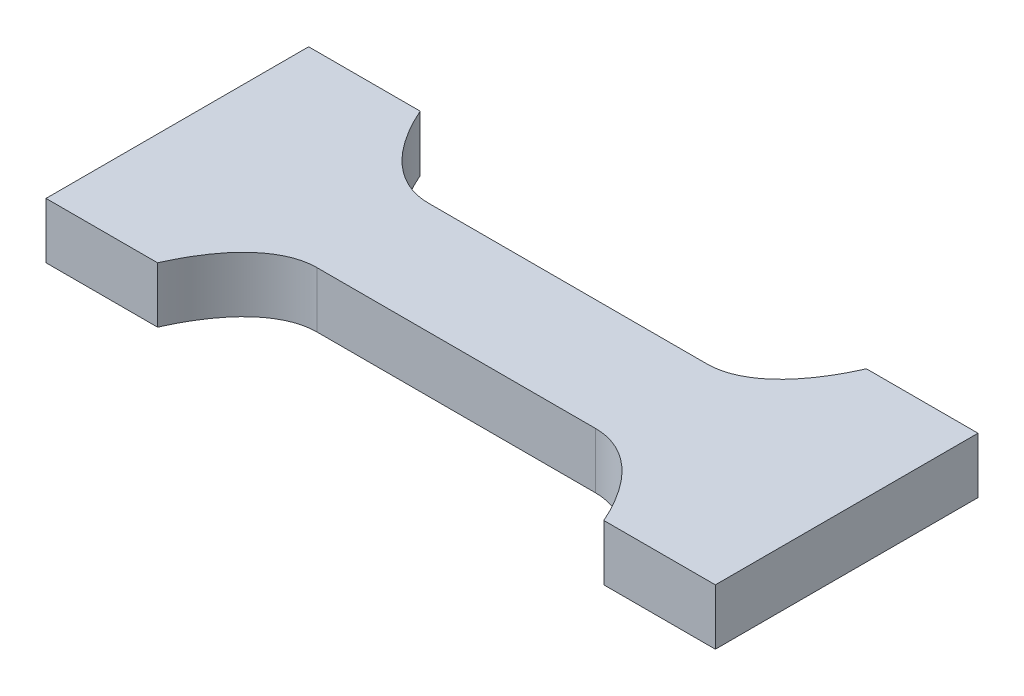
ISO-10303-21;
HEADER;
FILE_DESCRIPTION(('STEP AP214'),'2;1');
FILE_NAME('part.step','',(''),(''),'','','');
FILE_SCHEMA(('AUTOMOTIVE_DESIGN { 1 0 10303 214 1 1 1 1 }'));
ENDSEC;
DATA;
#1=APPLICATION_CONTEXT('core data for automotive mechanical design processes');
#2=APPLICATION_PROTOCOL_DEFINITION('international standard','automotive_design',2000,#1);
#3=PRODUCT_CONTEXT('',#1,'mechanical');
#4=PRODUCT('Part','Part','',(#3));
#5=PRODUCT_RELATED_PRODUCT_CATEGORY('part','',(#4));
#6=PRODUCT_DEFINITION_FORMATION('','',#4);
#7=PRODUCT_DEFINITION_CONTEXT('part definition',#1,'design');
#8=PRODUCT_DEFINITION('design','',#6,#7);
#9=PRODUCT_DEFINITION_SHAPE('','',#8);
#10=(LENGTH_UNIT() NAMED_UNIT(*) SI_UNIT(.MILLI.,.METRE.));
#11=(NAMED_UNIT(*) PLANE_ANGLE_UNIT() SI_UNIT($,.RADIAN.));
#12=(NAMED_UNIT(*) SI_UNIT($,.STERADIAN.) SOLID_ANGLE_UNIT());
#13=UNCERTAINTY_MEASURE_WITH_UNIT(LENGTH_MEASURE(1.E-05),#10,'distance_accuracy_value','');
#14=(GEOMETRIC_REPRESENTATION_CONTEXT(3) GLOBAL_UNCERTAINTY_ASSIGNED_CONTEXT((#13)) GLOBAL_UNIT_ASSIGNED_CONTEXT((#10,
#11,#12)) REPRESENTATION_CONTEXT('',''));
#15=CARTESIAN_POINT('',(0.,0.,0.));
#16=DIRECTION('',(0.,0.,1.));
#17=DIRECTION('',(1.,0.,0.));
#18=AXIS2_PLACEMENT_3D('',#15,#16,#17);
#19=CARTESIAN_POINT('',(54.,4.,-3.));
#20=DIRECTION('',(0.,0.,1.));
#21=DIRECTION('',(1.,0.,0.));
#22=AXIS2_PLACEMENT_3D('',#19,#20,#21);
#23=PLANE('',#22);
#24=DIRECTION('',(-1.,0.,0.));
#25=VECTOR('',#24,1.);
#26=CARTESIAN_POINT('',(54.,1.,-3.));
#27=LINE('',#26,#25);
#28=CARTESIAN_POINT('',(78.,1.,-3.));
#29=VERTEX_POINT('',#28);
#30=CARTESIAN_POINT('',(63.,1.,-3.));
#31=VERTEX_POINT('',#30);
#32=EDGE_CURVE('E163',#29,#31,#27,.T.);
#33=ORIENTED_EDGE('',*,*,#32,.T.);
#34=DIRECTION('',(0.,-1.,0.));
#35=VECTOR('',#34,1.);
#36=CARTESIAN_POINT('',(63.,4.,-3.));
#37=LINE('',#36,#35);
#38=CARTESIAN_POINT('',(63.,4.,-3.));
#39=VERTEX_POINT('',#38);
#40=EDGE_CURVE('E166',#39,#31,#37,.T.);
#41=ORIENTED_EDGE('',*,*,#40,.F.);
#42=DIRECTION('',(-1.,0.,0.));
#43=VECTOR('',#42,1.);
#44=CARTESIAN_POINT('',(54.,4.,-3.));
#45=LINE('',#44,#43);
#46=CARTESIAN_POINT('',(78.,4.,-3.));
#47=VERTEX_POINT('',#46);
#48=EDGE_CURVE('E86',#47,#39,#45,.T.);
#49=ORIENTED_EDGE('',*,*,#48,.F.);
#50=DIRECTION('',(0.,-1.,0.));
#51=VECTOR('',#50,1.);
#52=CARTESIAN_POINT('',(78.,4.,-3.));
#53=LINE('',#52,#51);
#54=EDGE_CURVE('E144',#47,#29,#53,.T.);
#55=ORIENTED_EDGE('',*,*,#54,.T.);
#56=EDGE_LOOP('',(#33,#41,#49,#55));
#57=FACE_BOUND('',#56,.T.);
#58=ADVANCED_FACE('F36',(#57),#23,.F.);
#59=CARTESIAN_POINT('',(54.,4.,-15.));
#60=DIRECTION('',(0.,1.,0.));
#61=DIRECTION('',(0.,0.,1.));
#62=AXIS2_PLACEMENT_3D('',#59,#60,#61);
#63=PLANE('',#62);
#64=ORIENTED_EDGE('',*,*,#48,.T.);
#65=CARTESIAN_POINT('',(63.,4.,-3.));
#66=CARTESIAN_POINT('',(61.2509842672249,4.,-3.));
#67=CARTESIAN_POINT('',(59.6568651670156,4.,-4.4392224676436));
#68=CARTESIAN_POINT('',(58.5,4.,-7.06274606680623));
#69=(BOUNDED_CURVE() B_SPLINE_CURVE(3,(#65,#66,#67,#68),.UNSPECIFIED.,.F.,
.F.) B_SPLINE_CURVE_WITH_KNOTS((4,4),(0.,1.),
.UNSPECIFIED.) CURVE() GEOMETRIC_REPRESENTATION_ITEM() RATIONAL_B_SPLINE_CURVE((1.,
0.940958551844098,0.940958551844098,1.)) REPRESENTATION_ITEM(''));
#70=CARTESIAN_POINT('',(58.5,4.,-7.06274606680623));
#71=VERTEX_POINT('',#70);
#72=EDGE_CURVE('E240',#39,#71,#69,.T.);
#73=ORIENTED_EDGE('',*,*,#72,.T.);
#74=DIRECTION('',(-1.,0.,0.));
#75=VECTOR('',#74,1.);
#76=CARTESIAN_POINT('',(52.5,4.,-7.06274606680623));
#77=LINE('',#76,#75);
#78=CARTESIAN_POINT('',(52.5,4.,-7.06274606680623));
#79=VERTEX_POINT('',#78);
#80=EDGE_CURVE('E95',#71,#79,#77,.T.);
#81=ORIENTED_EDGE('',*,*,#80,.T.);
#82=DIRECTION('',(0.,0.,1.));
#83=VECTOR('',#82,1.);
#84=CARTESIAN_POINT('',(52.5,4.,0.));
#85=LINE('',#84,#83);
#86=CARTESIAN_POINT('',(52.5,4.,7.06274606680623));
#87=VERTEX_POINT('',#86);
#88=EDGE_CURVE('E270',#79,#87,#85,.T.);
#89=ORIENTED_EDGE('',*,*,#88,.T.);
#90=DIRECTION('',(-1.,0.,0.));
#91=VECTOR('',#90,1.);
#92=CARTESIAN_POINT('',(52.5,4.,7.06274606680623));
#93=LINE('',#92,#91);
#94=CARTESIAN_POINT('',(58.5,4.,7.06274606680623));
#95=VERTEX_POINT('',#94);
#96=EDGE_CURVE('E274',#95,#87,#93,.T.);
#97=ORIENTED_EDGE('',*,*,#96,.F.);
#98=CARTESIAN_POINT('',(63.,4.,3.));
#99=CARTESIAN_POINT('',(61.2509842672249,4.,3.));
#100=CARTESIAN_POINT('',(59.6568651670156,4.,4.4392224676436));
#101=CARTESIAN_POINT('',(58.5,4.,7.06274606680623));
#102=(BOUNDED_CURVE() B_SPLINE_CURVE(3,(#98,#99,#100,#101),.UNSPECIFIED.,.F.,
.F.) B_SPLINE_CURVE_WITH_KNOTS((4,4),(0.,1.),
.UNSPECIFIED.) CURVE() GEOMETRIC_REPRESENTATION_ITEM() RATIONAL_B_SPLINE_CURVE((1.,
0.940958551844098,0.940958551844098,1.)) REPRESENTATION_ITEM(''));
#103=CARTESIAN_POINT('',(63.,4.,3.));
#104=VERTEX_POINT('',#103);
#105=EDGE_CURVE('E277',#104,#95,#102,.T.);
#106=ORIENTED_EDGE('',*,*,#105,.F.);
#107=DIRECTION('',(-1.,0.,0.));
#108=VECTOR('',#107,1.);
#109=CARTESIAN_POINT('',(54.,4.,3.));
#110=LINE('',#109,#108);
#111=CARTESIAN_POINT('',(78.,4.,3.));
#112=VERTEX_POINT('',#111);
#113=EDGE_CURVE('E159',#112,#104,#110,.T.);
#114=ORIENTED_EDGE('',*,*,#113,.F.);
#115=CARTESIAN_POINT('',(78.,4.,3.));
#116=CARTESIAN_POINT('',(79.7490157327751,4.,3.));
#117=CARTESIAN_POINT('',(81.3431348329844,4.,4.4392224676436));
#118=CARTESIAN_POINT('',(82.5,4.,7.06274606680623));
#119=(BOUNDED_CURVE() B_SPLINE_CURVE(3,(#115,#116,#117,#118),.UNSPECIFIED.,.F.,
.F.) B_SPLINE_CURVE_WITH_KNOTS((4,4),(0.,1.),
.UNSPECIFIED.) CURVE() GEOMETRIC_REPRESENTATION_ITEM() RATIONAL_B_SPLINE_CURVE((1.,
0.940958551844098,0.940958551844098,1.)) REPRESENTATION_ITEM(''));
#120=CARTESIAN_POINT('',(82.5,4.,7.06274606680623));
#121=VERTEX_POINT('',#120);
#122=EDGE_CURVE('E150',#112,#121,#119,.T.);
#123=ORIENTED_EDGE('',*,*,#122,.T.);
#124=DIRECTION('',(1.,0.,0.));
#125=VECTOR('',#124,1.);
#126=CARTESIAN_POINT('',(88.5,4.,7.06274606680623));
#127=LINE('',#126,#125);
#128=CARTESIAN_POINT('',(88.5,4.,7.06274606680623));
#129=VERTEX_POINT('',#128);
#130=EDGE_CURVE('E160',#121,#129,#127,.T.);
#131=ORIENTED_EDGE('',*,*,#130,.T.);
#132=DIRECTION('',(0.,0.,1.));
#133=VECTOR('',#132,1.);
#134=CARTESIAN_POINT('',(88.5,4.,0.));
#135=LINE('',#134,#133);
#136=CARTESIAN_POINT('',(88.5,4.,-7.06274606680623));
#137=VERTEX_POINT('',#136);
#138=EDGE_CURVE('E139',#137,#129,#135,.T.);
#139=ORIENTED_EDGE('',*,*,#138,.F.);
#140=DIRECTION('',(1.,0.,0.));
#141=VECTOR('',#140,1.);
#142=CARTESIAN_POINT('',(88.5,4.,-7.06274606680623));
#143=LINE('',#142,#141);
#144=CARTESIAN_POINT('',(82.5,4.,-7.06274606680623));
#145=VERTEX_POINT('',#144);
#146=EDGE_CURVE('E126',#145,#137,#143,.T.);
#147=ORIENTED_EDGE('',*,*,#146,.F.);
#148=CARTESIAN_POINT('',(78.,4.,-3.));
#149=CARTESIAN_POINT('',(79.7490157327751,4.,-3.));
#150=CARTESIAN_POINT('',(81.3431348329844,4.,-4.4392224676436));
#151=CARTESIAN_POINT('',(82.5,4.,-7.06274606680623));
#152=(BOUNDED_CURVE() B_SPLINE_CURVE(3,(#148,#149,#150,#151),.UNSPECIFIED.,.F.,
.F.) B_SPLINE_CURVE_WITH_KNOTS((4,4),(0.,1.),
.UNSPECIFIED.) CURVE() GEOMETRIC_REPRESENTATION_ITEM() RATIONAL_B_SPLINE_CURVE((1.,
0.940958551844098,0.940958551844098,1.)) REPRESENTATION_ITEM(''));
#153=EDGE_CURVE('E133',#47,#145,#152,.T.);
#154=ORIENTED_EDGE('',*,*,#153,.F.);
#155=EDGE_LOOP('',(#64,#73,#81,#89,#97,#106,#114,#123,#131,#139,#147,#154));
#156=FACE_BOUND('',#155,.T.);
#157=ADVANCED_FACE('F137',(#156),#63,.T.);
#158=CARTESIAN_POINT('',(54.,1.,-15.));
#159=DIRECTION('',(0.,1.,0.));
#160=DIRECTION('',(0.,0.,1.));
#161=AXIS2_PLACEMENT_3D('',#158,#159,#160);
#162=PLANE('',#161);
#163=DIRECTION('',(-1.,0.,0.));
#164=VECTOR('',#163,1.);
#165=CARTESIAN_POINT('',(54.,1.,3.));
#166=LINE('',#165,#164);
#167=CARTESIAN_POINT('',(78.,1.,3.));
#168=VERTEX_POINT('',#167);
#169=CARTESIAN_POINT('',(63.,1.,3.));
#170=VERTEX_POINT('',#169);
#171=EDGE_CURVE('E39',#168,#170,#166,.T.);
#172=ORIENTED_EDGE('',*,*,#171,.T.);
#173=CARTESIAN_POINT('',(63.,1.,3.));
#174=CARTESIAN_POINT('',(61.2509842672249,1.,3.));
#175=CARTESIAN_POINT('',(59.6568651670156,1.,4.4392224676436));
#176=CARTESIAN_POINT('',(58.5,1.,7.06274606680623));
#177=(BOUNDED_CURVE() B_SPLINE_CURVE(3,(#173,#174,#175,#176),.UNSPECIFIED.,.F.,
.F.) B_SPLINE_CURVE_WITH_KNOTS((4,4),(0.,1.),
.UNSPECIFIED.) CURVE() GEOMETRIC_REPRESENTATION_ITEM() RATIONAL_B_SPLINE_CURVE((1.,
0.940958551844098,0.940958551844098,1.)) REPRESENTATION_ITEM(''));
#178=CARTESIAN_POINT('',(58.5,1.,7.06274606680623));
#179=VERTEX_POINT('',#178);
#180=EDGE_CURVE('E278',#170,#179,#177,.T.);
#181=ORIENTED_EDGE('',*,*,#180,.T.);
#182=DIRECTION('',(-1.,0.,0.));
#183=VECTOR('',#182,1.);
#184=CARTESIAN_POINT('',(52.5,1.,7.06274606680623));
#185=LINE('',#184,#183);
#186=CARTESIAN_POINT('',(52.5,1.,7.06274606680623));
#187=VERTEX_POINT('',#186);
#188=EDGE_CURVE('E291',#179,#187,#185,.T.);
#189=ORIENTED_EDGE('',*,*,#188,.T.);
#190=DIRECTION('',(0.,0.,1.));
#191=VECTOR('',#190,1.);
#192=CARTESIAN_POINT('',(52.5,1.,0.));
#193=LINE('',#192,#191);
#194=CARTESIAN_POINT('',(52.5,1.,-7.06274606680623));
#195=VERTEX_POINT('',#194);
#196=EDGE_CURVE('E249',#195,#187,#193,.T.);
#197=ORIENTED_EDGE('',*,*,#196,.F.);
#198=DIRECTION('',(-1.,0.,0.));
#199=VECTOR('',#198,1.);
#200=CARTESIAN_POINT('',(52.5,1.,-7.06274606680623));
#201=LINE('',#200,#199);
#202=CARTESIAN_POINT('',(58.5,1.,-7.06274606680623));
#203=VERTEX_POINT('',#202);
#204=EDGE_CURVE('E246',#203,#195,#201,.T.);
#205=ORIENTED_EDGE('',*,*,#204,.F.);
#206=CARTESIAN_POINT('',(63.,1.,-3.));
#207=CARTESIAN_POINT('',(61.2509842672249,1.,-3.));
#208=CARTESIAN_POINT('',(59.6568651670156,1.,-4.4392224676436));
#209=CARTESIAN_POINT('',(58.5,1.,-7.06274606680623));
#210=(BOUNDED_CURVE() B_SPLINE_CURVE(3,(#206,#207,#208,#209),.UNSPECIFIED.,.F.,
.F.) B_SPLINE_CURVE_WITH_KNOTS((4,4),(0.,1.),
.UNSPECIFIED.) CURVE() GEOMETRIC_REPRESENTATION_ITEM() RATIONAL_B_SPLINE_CURVE((1.,
0.940958551844098,0.940958551844098,1.)) REPRESENTATION_ITEM(''));
#211=EDGE_CURVE('E238',#31,#203,#210,.T.);
#212=ORIENTED_EDGE('',*,*,#211,.F.);
#213=ORIENTED_EDGE('',*,*,#32,.F.);
#214=CARTESIAN_POINT('',(78.,1.,-3.));
#215=CARTESIAN_POINT('',(79.7490157327751,1.,-3.));
#216=CARTESIAN_POINT('',(81.3431348329844,1.,-4.4392224676436));
#217=CARTESIAN_POINT('',(82.5,1.,-7.06274606680623));
#218=(BOUNDED_CURVE() B_SPLINE_CURVE(3,(#214,#215,#216,#217),.UNSPECIFIED.,.F.,
.F.) B_SPLINE_CURVE_WITH_KNOTS((4,4),(0.,1.),
.UNSPECIFIED.) CURVE() GEOMETRIC_REPRESENTATION_ITEM() RATIONAL_B_SPLINE_CURVE((1.,
0.940958551844098,0.940958551844098,1.)) REPRESENTATION_ITEM(''));
#219=CARTESIAN_POINT('',(82.5,1.,-7.06274606680623));
#220=VERTEX_POINT('',#219);
#221=EDGE_CURVE('E176',#29,#220,#218,.T.);
#222=ORIENTED_EDGE('',*,*,#221,.T.);
#223=DIRECTION('',(1.,0.,0.));
#224=VECTOR('',#223,1.);
#225=CARTESIAN_POINT('',(88.5,1.,-7.06274606680623));
#226=LINE('',#225,#224);
#227=CARTESIAN_POINT('',(88.5,1.,-7.06274606680623));
#228=VERTEX_POINT('',#227);
#229=EDGE_CURVE('E128',#220,#228,#226,.T.);
#230=ORIENTED_EDGE('',*,*,#229,.T.);
#231=DIRECTION('',(0.,0.,1.));
#232=VECTOR('',#231,1.);
#233=CARTESIAN_POINT('',(88.5,1.,0.));
#234=LINE('',#233,#232);
#235=CARTESIAN_POINT('',(88.5,1.,7.06274606680623));
#236=VERTEX_POINT('',#235);
#237=EDGE_CURVE('E167',#228,#236,#234,.T.);
#238=ORIENTED_EDGE('',*,*,#237,.T.);
#239=DIRECTION('',(1.,0.,0.));
#240=VECTOR('',#239,1.);
#241=CARTESIAN_POINT('',(88.5,1.,7.06274606680623));
#242=LINE('',#241,#240);
#243=CARTESIAN_POINT('',(82.5,1.,7.06274606680623));
#244=VERTEX_POINT('',#243);
#245=EDGE_CURVE('E45',#244,#236,#242,.T.);
#246=ORIENTED_EDGE('',*,*,#245,.F.);
#247=CARTESIAN_POINT('',(78.,1.,3.));
#248=CARTESIAN_POINT('',(79.7490157327751,1.,3.));
#249=CARTESIAN_POINT('',(81.3431348329844,1.,4.4392224676436));
#250=CARTESIAN_POINT('',(82.5,1.,7.06274606680623));
#251=(BOUNDED_CURVE() B_SPLINE_CURVE(3,(#247,#248,#249,#250),.UNSPECIFIED.,.F.,
.F.) B_SPLINE_CURVE_WITH_KNOTS((4,4),(0.,1.),
.UNSPECIFIED.) CURVE() GEOMETRIC_REPRESENTATION_ITEM() RATIONAL_B_SPLINE_CURVE((1.,
0.940958551844098,0.940958551844098,1.)) REPRESENTATION_ITEM(''));
#252=EDGE_CURVE('E54',#168,#244,#251,.T.);
#253=ORIENTED_EDGE('',*,*,#252,.F.);
#254=EDGE_LOOP('',(#172,#181,#189,#197,#205,#212,#213,#222,#230,#238,#246,#253));
#255=FACE_BOUND('',#254,.T.);
#256=ADVANCED_FACE('F222',(#255),#162,.F.);
#257=CARTESIAN_POINT('',(54.,4.,3.));
#258=DIRECTION('',(0.,0.,1.));
#259=DIRECTION('',(1.,0.,0.));
#260=AXIS2_PLACEMENT_3D('',#257,#258,#259);
#261=PLANE('',#260);
#262=ORIENTED_EDGE('',*,*,#113,.T.);
#263=DIRECTION('',(0.,-1.,0.));
#264=VECTOR('',#263,1.);
#265=CARTESIAN_POINT('',(63.,4.,3.));
#266=LINE('',#265,#264);
#267=EDGE_CURVE('E283',#104,#170,#266,.T.);
#268=ORIENTED_EDGE('',*,*,#267,.T.);
#269=ORIENTED_EDGE('',*,*,#171,.F.);
#270=DIRECTION('',(0.,-1.,0.));
#271=VECTOR('',#270,1.);
#272=CARTESIAN_POINT('',(78.,4.,3.));
#273=LINE('',#272,#271);
#274=EDGE_CURVE('E182',#112,#168,#273,.T.);
#275=ORIENTED_EDGE('',*,*,#274,.F.);
#276=EDGE_LOOP('',(#262,#268,#269,#275));
#277=FACE_BOUND('',#276,.T.);
#278=ADVANCED_FACE('F218',(#277),#261,.T.);
#279=CARTESIAN_POINT('',(88.5,4.,0.));
#280=DIRECTION('',(1.,0.,0.));
#281=DIRECTION('',(0.,0.,-1.));
#282=AXIS2_PLACEMENT_3D('',#279,#280,#281);
#283=PLANE('',#282);
#284=ORIENTED_EDGE('',*,*,#237,.F.);
#285=DIRECTION('',(0.,-1.,0.));
#286=VECTOR('',#285,1.);
#287=CARTESIAN_POINT('',(88.5,4.,-7.06274606680623));
#288=LINE('',#287,#286);
#289=EDGE_CURVE('E140',#137,#228,#288,.T.);
#290=ORIENTED_EDGE('',*,*,#289,.F.);
#291=ORIENTED_EDGE('',*,*,#138,.T.);
#292=DIRECTION('',(0.,-1.,0.));
#293=VECTOR('',#292,1.);
#294=CARTESIAN_POINT('',(88.5,4.,7.06274606680623));
#295=LINE('',#294,#293);
#296=EDGE_CURVE('E141',#129,#236,#295,.T.);
#297=ORIENTED_EDGE('',*,*,#296,.T.);
#298=EDGE_LOOP('',(#284,#290,#291,#297));
#299=FACE_BOUND('',#298,.T.);
#300=ADVANCED_FACE('F215',(#299),#283,.T.);
#301=CARTESIAN_POINT('',(88.5,4.,-7.06274606680623));
#302=DIRECTION('',(0.,0.,-1.));
#303=DIRECTION('',(-1.,0.,0.));
#304=AXIS2_PLACEMENT_3D('',#301,#302,#303);
#305=PLANE('',#304);
#306=ORIENTED_EDGE('',*,*,#229,.F.);
#307=DIRECTION('',(0.,-1.,0.));
#308=VECTOR('',#307,1.);
#309=CARTESIAN_POINT('',(82.5,4.,-7.06274606680623));
#310=LINE('',#309,#308);
#311=EDGE_CURVE('E123',#145,#220,#310,.T.);
#312=ORIENTED_EDGE('',*,*,#311,.F.);
#313=ORIENTED_EDGE('',*,*,#146,.T.);
#314=ORIENTED_EDGE('',*,*,#289,.T.);
#315=EDGE_LOOP('',(#306,#312,#313,#314));
#316=FACE_BOUND('',#315,.T.);
#317=ADVANCED_FACE('F125',(#316),#305,.T.);
#318=CARTESIAN_POINT('',(78.,4.,-27.));
#319=CARTESIAN_POINT('',(90.,4.,-27.));
#320=CARTESIAN_POINT('',(90.,4.,-3.));
#321=CARTESIAN_POINT('',(78.,4.,-3.));
#322=CARTESIAN_POINT('',(66.,4.,-2.99999999999999));
#323=CARTESIAN_POINT('',(66.,4.,-27.));
#324=CARTESIAN_POINT('',(78.,4.,-27.));
#325=(BOUNDED_CURVE() B_SPLINE_CURVE(3,(#318,#319,#320,#321,#322,#323,#324),.UNSPECIFIED.,.T.,
.F.) B_SPLINE_CURVE_WITH_KNOTS((4,3,4),(0.,0.5,1.),
.UNSPECIFIED.) CURVE() GEOMETRIC_REPRESENTATION_ITEM() RATIONAL_B_SPLINE_CURVE((1.,
0.333333333333333,0.333333333333333,1.,0.333333333333333,0.333333333333333,1.)) REPRESENTATION_ITEM(''));
#326=DIRECTION('',(0.,-1.,0.));
#327=VECTOR('',#326,1.);
#328=SURFACE_OF_LINEAR_EXTRUSION('',#325,#327);
#329=ORIENTED_EDGE('',*,*,#221,.F.);
#330=ORIENTED_EDGE('',*,*,#54,.F.);
#331=ORIENTED_EDGE('',*,*,#153,.T.);
#332=ORIENTED_EDGE('',*,*,#311,.T.);
#333=EDGE_LOOP('',(#329,#330,#331,#332));
#334=FACE_BOUND('',#333,.T.);
#335=ADVANCED_FACE('F143',(#334),#328,.F.);
#336=CARTESIAN_POINT('',(78.,4.,3.));
#337=CARTESIAN_POINT('',(90.,4.,3.));
#338=CARTESIAN_POINT('',(90.,4.,27.));
#339=CARTESIAN_POINT('',(78.,4.,27.));
#340=CARTESIAN_POINT('',(66.,4.,27.));
#341=CARTESIAN_POINT('',(66.,4.,3.));
#342=CARTESIAN_POINT('',(78.,4.,3.));
#343=(BOUNDED_CURVE() B_SPLINE_CURVE(3,(#336,#337,#338,#339,#340,#341,#342),.UNSPECIFIED.,.T.,
.F.) B_SPLINE_CURVE_WITH_KNOTS((4,3,4),(0.,0.5,1.),
.UNSPECIFIED.) CURVE() GEOMETRIC_REPRESENTATION_ITEM() RATIONAL_B_SPLINE_CURVE((1.,
0.333333333333333,0.333333333333333,1.,0.333333333333333,0.333333333333333,1.)) REPRESENTATION_ITEM(''));
#344=DIRECTION('',(0.,-1.,0.));
#345=VECTOR('',#344,1.);
#346=SURFACE_OF_LINEAR_EXTRUSION('',#343,#345);
#347=ORIENTED_EDGE('',*,*,#252,.T.);
#348=DIRECTION('',(0.,-1.,0.));
#349=VECTOR('',#348,1.);
#350=CARTESIAN_POINT('',(82.5,4.,7.06274606680623));
#351=LINE('',#350,#349);
#352=EDGE_CURVE('E11',#121,#244,#351,.T.);
#353=ORIENTED_EDGE('',*,*,#352,.F.);
#354=ORIENTED_EDGE('',*,*,#122,.F.);
#355=ORIENTED_EDGE('',*,*,#274,.T.);
#356=EDGE_LOOP('',(#347,#353,#354,#355));
#357=FACE_BOUND('',#356,.T.);
#358=ADVANCED_FACE('F211',(#357),#346,.F.);
#359=CARTESIAN_POINT('',(88.5,4.,7.06274606680623));
#360=DIRECTION('',(0.,0.,-1.));
#361=DIRECTION('',(-1.,0.,0.));
#362=AXIS2_PLACEMENT_3D('',#359,#360,#361);
#363=PLANE('',#362);
#364=ORIENTED_EDGE('',*,*,#245,.T.);
#365=ORIENTED_EDGE('',*,*,#296,.F.);
#366=ORIENTED_EDGE('',*,*,#130,.F.);
#367=ORIENTED_EDGE('',*,*,#352,.T.);
#368=EDGE_LOOP('',(#364,#365,#366,#367));
#369=FACE_BOUND('',#368,.T.);
#370=ADVANCED_FACE('F312',(#369),#363,.F.);
#371=CARTESIAN_POINT('',(63.,4.,-27.));
#372=CARTESIAN_POINT('',(75.,4.,-27.));
#373=CARTESIAN_POINT('',(75.,4.,-3.));
#374=CARTESIAN_POINT('',(63.,4.,-3.));
#375=CARTESIAN_POINT('',(51.,4.,-2.99999999999999));
#376=CARTESIAN_POINT('',(51.,4.,-27.));
#377=CARTESIAN_POINT('',(63.,4.,-27.));
#378=(BOUNDED_CURVE() B_SPLINE_CURVE(3,(#371,#372,#373,#374,#375,#376,#377),.UNSPECIFIED.,.T.,
.F.) B_SPLINE_CURVE_WITH_KNOTS((4,3,4),(0.,0.5,1.),
.UNSPECIFIED.) CURVE() GEOMETRIC_REPRESENTATION_ITEM() RATIONAL_B_SPLINE_CURVE((1.,
0.333333333333333,0.333333333333333,1.,0.333333333333333,0.333333333333333,1.)) REPRESENTATION_ITEM(''));
#379=DIRECTION('',(0.,-1.,0.));
#380=VECTOR('',#379,1.);
#381=SURFACE_OF_LINEAR_EXTRUSION('',#378,#380);
#382=ORIENTED_EDGE('',*,*,#211,.T.);
#383=DIRECTION('',(0.,-1.,0.));
#384=VECTOR('',#383,1.);
#385=CARTESIAN_POINT('',(58.5,4.,-7.06274606680623));
#386=LINE('',#385,#384);
#387=EDGE_CURVE('E241',#71,#203,#386,.T.);
#388=ORIENTED_EDGE('',*,*,#387,.F.);
#389=ORIENTED_EDGE('',*,*,#72,.F.);
#390=ORIENTED_EDGE('',*,*,#40,.T.);
#391=EDGE_LOOP('',(#382,#388,#389,#390));
#392=FACE_BOUND('',#391,.T.);
#393=ADVANCED_FACE('F236',(#392),#381,.F.);
#394=CARTESIAN_POINT('',(52.5,4.,-7.06274606680623));
#395=DIRECTION('',(0.,0.,1.));
#396=DIRECTION('',(1.,0.,0.));
#397=AXIS2_PLACEMENT_3D('',#394,#395,#396);
#398=PLANE('',#397);
#399=ORIENTED_EDGE('',*,*,#204,.T.);
#400=DIRECTION('',(0.,-1.,0.));
#401=VECTOR('',#400,1.);
#402=CARTESIAN_POINT('',(52.5,4.,-7.06274606680623));
#403=LINE('',#402,#401);
#404=EDGE_CURVE('E261',#79,#195,#403,.T.);
#405=ORIENTED_EDGE('',*,*,#404,.F.);
#406=ORIENTED_EDGE('',*,*,#80,.F.);
#407=ORIENTED_EDGE('',*,*,#387,.T.);
#408=EDGE_LOOP('',(#399,#405,#406,#407));
#409=FACE_BOUND('',#408,.T.);
#410=ADVANCED_FACE('F311',(#409),#398,.F.);
#411=CARTESIAN_POINT('',(52.5,4.,0.));
#412=DIRECTION('',(1.,0.,0.));
#413=DIRECTION('',(0.,0.,-1.));
#414=AXIS2_PLACEMENT_3D('',#411,#412,#413);
#415=PLANE('',#414);
#416=ORIENTED_EDGE('',*,*,#196,.T.);
#417=DIRECTION('',(0.,-1.,0.));
#418=VECTOR('',#417,1.);
#419=CARTESIAN_POINT('',(52.5,4.,7.06274606680623));
#420=LINE('',#419,#418);
#421=EDGE_CURVE('E247',#87,#187,#420,.T.);
#422=ORIENTED_EDGE('',*,*,#421,.F.);
#423=ORIENTED_EDGE('',*,*,#88,.F.);
#424=ORIENTED_EDGE('',*,*,#404,.T.);
#425=EDGE_LOOP('',(#416,#422,#423,#424));
#426=FACE_BOUND('',#425,.T.);
#427=ADVANCED_FACE('F315',(#426),#415,.F.);
#428=CARTESIAN_POINT('',(52.5,4.,7.06274606680623));
#429=DIRECTION('',(0.,0.,1.));
#430=DIRECTION('',(1.,0.,0.));
#431=AXIS2_PLACEMENT_3D('',#428,#429,#430);
#432=PLANE('',#431);
#433=ORIENTED_EDGE('',*,*,#188,.F.);
#434=DIRECTION('',(0.,-1.,0.));
#435=VECTOR('',#434,1.);
#436=CARTESIAN_POINT('',(58.5,4.,7.06274606680623));
#437=LINE('',#436,#435);
#438=EDGE_CURVE('E252',#95,#179,#437,.T.);
#439=ORIENTED_EDGE('',*,*,#438,.F.);
#440=ORIENTED_EDGE('',*,*,#96,.T.);
#441=ORIENTED_EDGE('',*,*,#421,.T.);
#442=EDGE_LOOP('',(#433,#439,#440,#441));
#443=FACE_BOUND('',#442,.T.);
#444=ADVANCED_FACE('F319',(#443),#432,.T.);
#445=CARTESIAN_POINT('',(63.,4.,3.));
#446=CARTESIAN_POINT('',(75.,4.,3.));
#447=CARTESIAN_POINT('',(75.,4.,27.));
#448=CARTESIAN_POINT('',(63.,4.,27.));
#449=CARTESIAN_POINT('',(51.,4.,27.));
#450=CARTESIAN_POINT('',(51.,4.,3.));
#451=CARTESIAN_POINT('',(63.,4.,3.));
#452=(BOUNDED_CURVE() B_SPLINE_CURVE(3,(#445,#446,#447,#448,#449,#450,#451),.UNSPECIFIED.,.T.,
.F.) B_SPLINE_CURVE_WITH_KNOTS((4,3,4),(0.,0.5,1.),
.UNSPECIFIED.) CURVE() GEOMETRIC_REPRESENTATION_ITEM() RATIONAL_B_SPLINE_CURVE((1.,
0.333333333333333,0.333333333333333,1.,0.333333333333333,0.333333333333333,1.)) REPRESENTATION_ITEM(''));
#453=DIRECTION('',(0.,-1.,0.));
#454=VECTOR('',#453,1.);
#455=SURFACE_OF_LINEAR_EXTRUSION('',#452,#454);
#456=ORIENTED_EDGE('',*,*,#180,.F.);
#457=ORIENTED_EDGE('',*,*,#267,.F.);
#458=ORIENTED_EDGE('',*,*,#105,.T.);
#459=ORIENTED_EDGE('',*,*,#438,.T.);
#460=EDGE_LOOP('',(#456,#457,#458,#459));
#461=FACE_BOUND('',#460,.T.);
#462=ADVANCED_FACE('F323',(#461),#455,.F.);
#463=CLOSED_SHELL('',(#58,#157,#256,#278,#300,#317,#335,#358,#370,#393,#410,#427,#444,#462));
#464=MANIFOLD_SOLID_BREP('B2',#463);
#465=ADVANCED_BREP_SHAPE_REPRESENTATION('',(#18,#464),#14);
#466=SHAPE_DEFINITION_REPRESENTATION(#9,#465);
ENDSEC;
END-ISO-10303-21;
